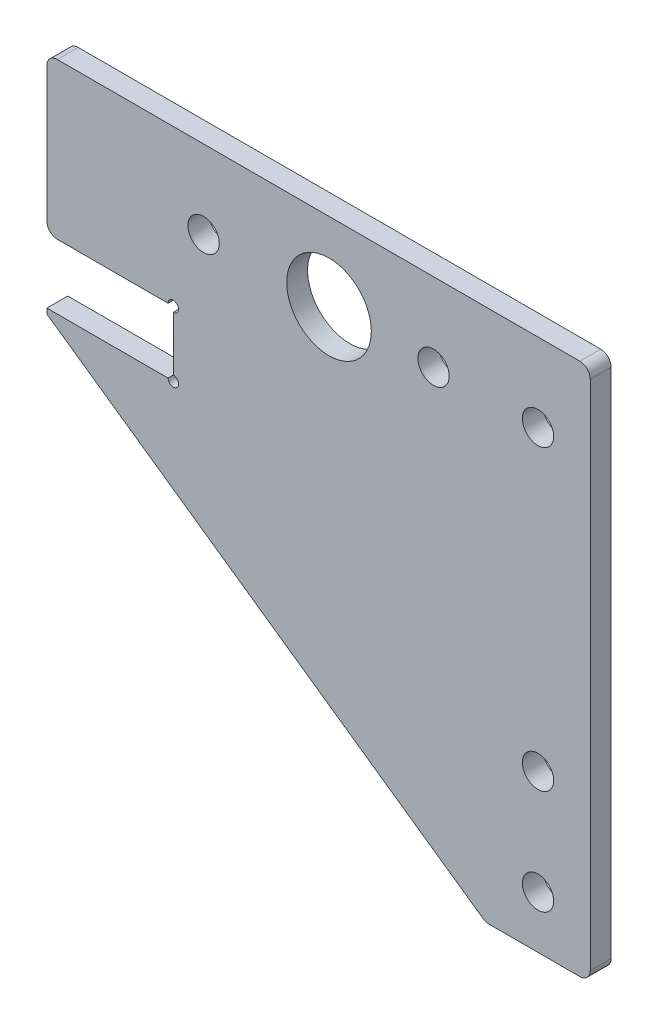
ISO-10303-21;
HEADER;
FILE_DESCRIPTION(('STEP AP214'),'2;1');
FILE_NAME('part.step','',(''),(''),'','','');
FILE_SCHEMA(('AUTOMOTIVE_DESIGN { 1 0 10303 214 1 1 1 1 }'));
ENDSEC;
DATA;
#1=APPLICATION_CONTEXT('core data for automotive mechanical design processes');
#2=APPLICATION_PROTOCOL_DEFINITION('international standard','automotive_design',2000,#1);
#3=PRODUCT_CONTEXT('',#1,'mechanical');
#4=PRODUCT('Part','Part','',(#3));
#5=PRODUCT_RELATED_PRODUCT_CATEGORY('part','',(#4));
#6=PRODUCT_DEFINITION_FORMATION('','',#4);
#7=PRODUCT_DEFINITION_CONTEXT('part definition',#1,'design');
#8=PRODUCT_DEFINITION('design','',#6,#7);
#9=PRODUCT_DEFINITION_SHAPE('','',#8);
#10=(LENGTH_UNIT() NAMED_UNIT(*) SI_UNIT(.MILLI.,.METRE.));
#11=(NAMED_UNIT(*) PLANE_ANGLE_UNIT() SI_UNIT($,.RADIAN.));
#12=(NAMED_UNIT(*) SI_UNIT($,.STERADIAN.) SOLID_ANGLE_UNIT());
#13=UNCERTAINTY_MEASURE_WITH_UNIT(LENGTH_MEASURE(1.E-05),#10,'distance_accuracy_value','');
#14=(GEOMETRIC_REPRESENTATION_CONTEXT(3) GLOBAL_UNCERTAINTY_ASSIGNED_CONTEXT((#13)) GLOBAL_UNIT_ASSIGNED_CONTEXT((#10,
#11,#12)) REPRESENTATION_CONTEXT('',''));
#15=CARTESIAN_POINT('',(0.,0.,0.));
#16=DIRECTION('',(0.,0.,1.));
#17=DIRECTION('',(1.,0.,0.));
#18=AXIS2_PLACEMENT_3D('',#15,#16,#17);
#19=CARTESIAN_POINT('',(0.,0.,2.));
#20=DIRECTION('',(0.,0.,-1.));
#21=DIRECTION('',(-1.,0.,0.));
#22=AXIS2_PLACEMENT_3D('',#19,#20,#21);
#23=PLANE('',#22);
#24=DIRECTION('',(0.819152044288991,-0.573576436351047,0.));
#25=VECTOR('',#24,1.);
#26=CARTESIAN_POINT('',(-47.,-14.0912833951921,2.));
#27=LINE('',#26,#25);
#28=CARTESIAN_POINT('',(-47.,-14.0912833951921,2.));
#29=VERTEX_POINT('',#28);
#30=CARTESIAN_POINT('',(-5.25827764747206,-43.319152044289,2.));
#31=VERTEX_POINT('',#30);
#32=EDGE_CURVE('E280',#29,#31,#27,.T.);
#33=ORIENTED_EDGE('',*,*,#32,.T.);
#34=CARTESIAN_POINT('',(-4.68470121112101,-42.5,2.));
#35=DIRECTION('',(0.,0.,-1.));
#36=DIRECTION('',(-1.,0.,0.));
#37=AXIS2_PLACEMENT_3D('',#34,#35,#36);
#38=CIRCLE('',#37,1.);
#39=CARTESIAN_POINT('',(-4.68470121112101,-43.5,2.));
#40=VERTEX_POINT('',#39);
#41=EDGE_CURVE('E236',#31,#40,#38,.F.);
#42=ORIENTED_EDGE('',*,*,#41,.T.);
#43=DIRECTION('',(1.,0.,0.));
#44=VECTOR('',#43,1.);
#45=CARTESIAN_POINT('',(-5.,-43.5,2.));
#46=LINE('',#45,#44);
#47=CARTESIAN_POINT('',(4.,-43.5,2.));
#48=VERTEX_POINT('',#47);
#49=EDGE_CURVE('E283',#40,#48,#46,.T.);
#50=ORIENTED_EDGE('',*,*,#49,.T.);
#51=CARTESIAN_POINT('',(4.,-42.5,2.));
#52=DIRECTION('',(0.,0.,-1.));
#53=DIRECTION('',(-1.,0.,0.));
#54=AXIS2_PLACEMENT_3D('',#51,#52,#53);
#55=CIRCLE('',#54,1.);
#56=CARTESIAN_POINT('',(5.,-42.5,2.));
#57=VERTEX_POINT('',#56);
#58=EDGE_CURVE('E234',#48,#57,#55,.F.);
#59=ORIENTED_EDGE('',*,*,#58,.T.);
#60=DIRECTION('',(0.,1.,0.));
#61=VECTOR('',#60,1.);
#62=CARTESIAN_POINT('',(5.,-43.5,2.));
#63=LINE('',#62,#61);
#64=CARTESIAN_POINT('',(5.,6.50000000000001,2.));
#65=VERTEX_POINT('',#64);
#66=EDGE_CURVE('E286',#57,#65,#63,.T.);
#67=ORIENTED_EDGE('',*,*,#66,.T.);
#68=CARTESIAN_POINT('',(4.,6.5,2.));
#69=DIRECTION('',(0.,0.,-1.));
#70=DIRECTION('',(-1.,0.,0.));
#71=AXIS2_PLACEMENT_3D('',#68,#69,#70);
#72=CIRCLE('',#71,1.);
#73=CARTESIAN_POINT('',(4.,7.5,2.));
#74=VERTEX_POINT('',#73);
#75=EDGE_CURVE('E232',#65,#74,#72,.F.);
#76=ORIENTED_EDGE('',*,*,#75,.T.);
#77=DIRECTION('',(-1.,0.,0.));
#78=VECTOR('',#77,1.);
#79=CARTESIAN_POINT('',(5.,7.5,2.));
#80=LINE('',#79,#78);
#81=CARTESIAN_POINT('',(-46.,7.50000000000001,2.));
#82=VERTEX_POINT('',#81);
#83=EDGE_CURVE('E289',#74,#82,#80,.T.);
#84=ORIENTED_EDGE('',*,*,#83,.T.);
#85=CARTESIAN_POINT('',(-46.,6.50000000000001,2.));
#86=DIRECTION('',(0.,0.,-1.));
#87=DIRECTION('',(-1.,0.,0.));
#88=AXIS2_PLACEMENT_3D('',#85,#86,#87);
#89=CIRCLE('',#88,1.);
#90=CARTESIAN_POINT('',(-47.,6.50000000000001,2.));
#91=VERTEX_POINT('',#90);
#92=EDGE_CURVE('E58',#82,#91,#89,.F.);
#93=ORIENTED_EDGE('',*,*,#92,.T.);
#94=DIRECTION('',(0.,-1.,0.));
#95=VECTOR('',#94,1.);
#96=CARTESIAN_POINT('',(-47.,7.50000000000001,2.));
#97=LINE('',#96,#95);
#98=CARTESIAN_POINT('',(-47.,-6.4,2.));
#99=VERTEX_POINT('',#98);
#100=EDGE_CURVE('E206',#91,#99,#97,.T.);
#101=ORIENTED_EDGE('',*,*,#100,.T.);
#102=CARTESIAN_POINT('',(-46.,-6.4,2.));
#103=DIRECTION('',(0.,0.,-1.));
#104=DIRECTION('',(-1.,0.,0.));
#105=AXIS2_PLACEMENT_3D('',#102,#103,#104);
#106=CIRCLE('',#105,1.);
#107=CARTESIAN_POINT('',(-46.,-7.4,2.));
#108=VERTEX_POINT('',#107);
#109=EDGE_CURVE('E230',#99,#108,#106,.F.);
#110=ORIENTED_EDGE('',*,*,#109,.T.);
#111=DIRECTION('',(1.,0.,0.));
#112=VECTOR('',#111,1.);
#113=CARTESIAN_POINT('',(-47.,-7.4,2.));
#114=LINE('',#113,#112);
#115=CARTESIAN_POINT('',(-35.4,-7.4,2.));
#116=VERTEX_POINT('',#115);
#117=EDGE_CURVE('E201',#108,#116,#114,.T.);
#118=ORIENTED_EDGE('',*,*,#117,.T.);
#119=CARTESIAN_POINT('',(-34.9,-7.4,2.));
#120=DIRECTION('',(0.,0.,-1.));
#121=DIRECTION('',(-1.,0.,0.));
#122=AXIS2_PLACEMENT_3D('',#119,#120,#121);
#123=CIRCLE('',#122,0.499999999999999);
#124=CARTESIAN_POINT('',(-34.9,-7.9,2.));
#125=VERTEX_POINT('',#124);
#126=EDGE_CURVE('E161',#116,#125,#123,.T.);
#127=ORIENTED_EDGE('',*,*,#126,.T.);
#128=DIRECTION('',(0.,-1.,0.));
#129=VECTOR('',#128,1.);
#130=CARTESIAN_POINT('',(-34.9,-7.4,2.));
#131=LINE('',#130,#129);
#132=CARTESIAN_POINT('',(-34.9,-13.1,2.));
#133=VERTEX_POINT('',#132);
#134=EDGE_CURVE('E269',#125,#133,#131,.T.);
#135=ORIENTED_EDGE('',*,*,#134,.T.);
#136=CARTESIAN_POINT('',(-34.9,-13.6,2.));
#137=DIRECTION('',(0.,0.,-1.));
#138=DIRECTION('',(-1.,0.,0.));
#139=AXIS2_PLACEMENT_3D('',#136,#137,#138);
#140=CIRCLE('',#139,0.499999999999999);
#141=CARTESIAN_POINT('',(-35.4,-13.6,2.));
#142=VERTEX_POINT('',#141);
#143=EDGE_CURVE('E156',#133,#142,#140,.T.);
#144=ORIENTED_EDGE('',*,*,#143,.T.);
#145=DIRECTION('',(-1.,0.,0.));
#146=VECTOR('',#145,1.);
#147=CARTESIAN_POINT('',(-34.9,-13.6,2.));
#148=LINE('',#147,#146);
#149=CARTESIAN_POINT('',(-47.,-13.6,2.));
#150=VERTEX_POINT('',#149);
#151=EDGE_CURVE('E271',#142,#150,#148,.T.);
#152=ORIENTED_EDGE('',*,*,#151,.T.);
#153=DIRECTION('',(0.,-1.,0.));
#154=VECTOR('',#153,1.);
#155=CARTESIAN_POINT('',(-47.,-13.6,2.));
#156=LINE('',#155,#154);
#157=EDGE_CURVE('E278',#150,#29,#156,.T.);
#158=ORIENTED_EDGE('',*,*,#157,.T.);
#159=EDGE_LOOP('',(#33,#42,#50,#59,#67,#76,#84,#93,#101,#110,#118,#127,#135,#144,#152,#158));
#160=FACE_BOUND('',#159,.T.);
#161=CARTESIAN_POINT('',(0.,0.,2.));
#162=DIRECTION('',(0.,0.,1.));
#163=DIRECTION('',(1.,0.,0.));
#164=AXIS2_PLACEMENT_3D('',#161,#162,#163);
#165=CIRCLE('',#164,1.5);
#166=CARTESIAN_POINT('',(1.5,0.,2.));
#167=VERTEX_POINT('',#166);
#168=EDGE_CURVE('E182',#167,#167,#165,.T.);
#169=ORIENTED_EDGE('',*,*,#168,.F.);
#170=EDGE_LOOP('',(#169));
#171=FACE_BOUND('',#170,.T.);
#172=CARTESIAN_POINT('',(-32.,0.,2.));
#173=DIRECTION('',(0.,0.,1.));
#174=DIRECTION('',(1.,0.,0.));
#175=AXIS2_PLACEMENT_3D('',#172,#173,#174);
#176=CIRCLE('',#175,1.50000000000003);
#177=CARTESIAN_POINT('',(-30.5,0.,2.));
#178=VERTEX_POINT('',#177);
#179=EDGE_CURVE('E301',#178,#178,#176,.T.);
#180=ORIENTED_EDGE('',*,*,#179,.F.);
#181=EDGE_LOOP('',(#180));
#182=FACE_BOUND('',#181,.T.);
#183=CARTESIAN_POINT('',(0.,-28.5,2.));
#184=DIRECTION('',(0.,0.,1.));
#185=DIRECTION('',(1.,0.,0.));
#186=AXIS2_PLACEMENT_3D('',#183,#184,#185);
#187=CIRCLE('',#186,1.5);
#188=CARTESIAN_POINT('',(1.5,-28.5,2.));
#189=VERTEX_POINT('',#188);
#190=EDGE_CURVE('E305',#189,#189,#187,.T.);
#191=ORIENTED_EDGE('',*,*,#190,.F.);
#192=EDGE_LOOP('',(#191));
#193=FACE_BOUND('',#192,.T.);
#194=CARTESIAN_POINT('',(-10.,0.,2.));
#195=DIRECTION('',(0.,0.,1.));
#196=DIRECTION('',(1.,0.,0.));
#197=AXIS2_PLACEMENT_3D('',#194,#195,#196);
#198=CIRCLE('',#197,1.5);
#199=CARTESIAN_POINT('',(-8.5,0.,2.));
#200=VERTEX_POINT('',#199);
#201=EDGE_CURVE('E309',#200,#200,#198,.T.);
#202=ORIENTED_EDGE('',*,*,#201,.F.);
#203=EDGE_LOOP('',(#202));
#204=FACE_BOUND('',#203,.T.);
#205=CARTESIAN_POINT('',(0.,-38.5,2.));
#206=DIRECTION('',(0.,0.,1.));
#207=DIRECTION('',(1.,0.,0.));
#208=AXIS2_PLACEMENT_3D('',#205,#206,#207);
#209=CIRCLE('',#208,1.5);
#210=CARTESIAN_POINT('',(1.50000000000001,-38.5,2.));
#211=VERTEX_POINT('',#210);
#212=EDGE_CURVE('E313',#211,#211,#209,.T.);
#213=ORIENTED_EDGE('',*,*,#212,.F.);
#214=EDGE_LOOP('',(#213));
#215=FACE_BOUND('',#214,.T.);
#216=CARTESIAN_POINT('',(-20.,0.,2.));
#217=DIRECTION('',(0.,0.,1.));
#218=DIRECTION('',(1.,0.,0.));
#219=AXIS2_PLACEMENT_3D('',#216,#217,#218);
#220=CIRCLE('',#219,4.05);
#221=CARTESIAN_POINT('',(-15.95,0.,2.));
#222=VERTEX_POINT('',#221);
#223=EDGE_CURVE('E316',#222,#222,#220,.T.);
#224=ORIENTED_EDGE('',*,*,#223,.F.);
#225=EDGE_LOOP('',(#224));
#226=FACE_BOUND('',#225,.T.);
#227=ADVANCED_FACE('F38',(#160,#171,#182,#193,#204,#215,#226),#23,.F.);
#228=CARTESIAN_POINT('',(0.,0.,0.));
#229=DIRECTION('',(0.,0.,-1.));
#230=DIRECTION('',(-1.,0.,0.));
#231=AXIS2_PLACEMENT_3D('',#228,#229,#230);
#232=PLANE('',#231);
#233=DIRECTION('',(1.,0.,0.));
#234=VECTOR('',#233,1.);
#235=CARTESIAN_POINT('',(-5.,-43.5,0.));
#236=LINE('',#235,#234);
#237=CARTESIAN_POINT('',(-4.68470121112101,-43.5,0.));
#238=VERTEX_POINT('',#237);
#239=CARTESIAN_POINT('',(4.,-43.5,0.));
#240=VERTEX_POINT('',#239);
#241=EDGE_CURVE('E190',#238,#240,#236,.T.);
#242=ORIENTED_EDGE('',*,*,#241,.F.);
#243=CARTESIAN_POINT('',(-4.68470121112101,-42.5,0.));
#244=DIRECTION('',(0.,0.,-1.));
#245=DIRECTION('',(-1.,0.,0.));
#246=AXIS2_PLACEMENT_3D('',#243,#244,#245);
#247=CIRCLE('',#246,1.);
#248=CARTESIAN_POINT('',(-5.25827764747206,-43.319152044289,0.));
#249=VERTEX_POINT('',#248);
#250=EDGE_CURVE('E225',#238,#249,#247,.T.);
#251=ORIENTED_EDGE('',*,*,#250,.T.);
#252=DIRECTION('',(0.819152044288991,-0.573576436351047,0.));
#253=VECTOR('',#252,1.);
#254=CARTESIAN_POINT('',(-47.,-14.0912833951921,0.));
#255=LINE('',#254,#253);
#256=CARTESIAN_POINT('',(-47.,-14.0912833951921,0.));
#257=VERTEX_POINT('',#256);
#258=EDGE_CURVE('E187',#257,#249,#255,.T.);
#259=ORIENTED_EDGE('',*,*,#258,.F.);
#260=DIRECTION('',(0.,-1.,0.));
#261=VECTOR('',#260,1.);
#262=CARTESIAN_POINT('',(-47.,-13.6,0.));
#263=LINE('',#262,#261);
#264=CARTESIAN_POINT('',(-47.,-13.6,0.));
#265=VERTEX_POINT('',#264);
#266=EDGE_CURVE('E180',#265,#257,#263,.T.);
#267=ORIENTED_EDGE('',*,*,#266,.F.);
#268=DIRECTION('',(-1.,0.,0.));
#269=VECTOR('',#268,1.);
#270=CARTESIAN_POINT('',(-34.9,-13.6,0.));
#271=LINE('',#270,#269);
#272=CARTESIAN_POINT('',(-35.4,-13.6,0.));
#273=VERTEX_POINT('',#272);
#274=EDGE_CURVE('E172',#273,#265,#271,.T.);
#275=ORIENTED_EDGE('',*,*,#274,.F.);
#276=CARTESIAN_POINT('',(-34.9,-13.6,0.));
#277=DIRECTION('',(0.,0.,-1.));
#278=DIRECTION('',(-1.,0.,0.));
#279=AXIS2_PLACEMENT_3D('',#276,#277,#278);
#280=CIRCLE('',#279,0.499999999999999);
#281=CARTESIAN_POINT('',(-34.9,-13.1,0.));
#282=VERTEX_POINT('',#281);
#283=EDGE_CURVE('E153',#282,#273,#280,.T.);
#284=ORIENTED_EDGE('',*,*,#283,.F.);
#285=DIRECTION('',(0.,-1.,0.));
#286=VECTOR('',#285,1.);
#287=CARTESIAN_POINT('',(-34.9,-7.4,0.));
#288=LINE('',#287,#286);
#289=CARTESIAN_POINT('',(-34.9,-7.9,0.));
#290=VERTEX_POINT('',#289);
#291=EDGE_CURVE('E170',#290,#282,#288,.T.);
#292=ORIENTED_EDGE('',*,*,#291,.F.);
#293=CARTESIAN_POINT('',(-34.9,-7.4,0.));
#294=DIRECTION('',(0.,0.,-1.));
#295=DIRECTION('',(-1.,0.,0.));
#296=AXIS2_PLACEMENT_3D('',#293,#294,#295);
#297=CIRCLE('',#296,0.499999999999999);
#298=CARTESIAN_POINT('',(-35.4,-7.4,0.));
#299=VERTEX_POINT('',#298);
#300=EDGE_CURVE('E173',#299,#290,#297,.T.);
#301=ORIENTED_EDGE('',*,*,#300,.F.);
#302=DIRECTION('',(1.,0.,0.));
#303=VECTOR('',#302,1.);
#304=CARTESIAN_POINT('',(-47.,-7.4,0.));
#305=LINE('',#304,#303);
#306=CARTESIAN_POINT('',(-46.,-7.4,0.));
#307=VERTEX_POINT('',#306);
#308=EDGE_CURVE('E178',#307,#299,#305,.T.);
#309=ORIENTED_EDGE('',*,*,#308,.F.);
#310=CARTESIAN_POINT('',(-46.,-6.4,0.));
#311=DIRECTION('',(0.,0.,-1.));
#312=DIRECTION('',(-1.,0.,0.));
#313=AXIS2_PLACEMENT_3D('',#310,#311,#312);
#314=CIRCLE('',#313,1.);
#315=CARTESIAN_POINT('',(-47.,-6.4,0.));
#316=VERTEX_POINT('',#315);
#317=EDGE_CURVE('E219',#307,#316,#314,.T.);
#318=ORIENTED_EDGE('',*,*,#317,.T.);
#319=DIRECTION('',(0.,-1.,0.));
#320=VECTOR('',#319,1.);
#321=CARTESIAN_POINT('',(-47.,7.50000000000001,0.));
#322=LINE('',#321,#320);
#323=CARTESIAN_POINT('',(-47.,6.50000000000001,0.));
#324=VERTEX_POINT('',#323);
#325=EDGE_CURVE('E199',#324,#316,#322,.T.);
#326=ORIENTED_EDGE('',*,*,#325,.F.);
#327=CARTESIAN_POINT('',(-46.,6.50000000000001,0.));
#328=DIRECTION('',(0.,0.,-1.));
#329=DIRECTION('',(-1.,0.,0.));
#330=AXIS2_PLACEMENT_3D('',#327,#328,#329);
#331=CIRCLE('',#330,1.);
#332=CARTESIAN_POINT('',(-46.,7.50000000000001,0.));
#333=VERTEX_POINT('',#332);
#334=EDGE_CURVE('E217',#324,#333,#331,.T.);
#335=ORIENTED_EDGE('',*,*,#334,.T.);
#336=DIRECTION('',(-1.,0.,0.));
#337=VECTOR('',#336,1.);
#338=CARTESIAN_POINT('',(5.,7.5,0.));
#339=LINE('',#338,#337);
#340=CARTESIAN_POINT('',(4.,7.5,0.));
#341=VERTEX_POINT('',#340);
#342=EDGE_CURVE('E196',#341,#333,#339,.T.);
#343=ORIENTED_EDGE('',*,*,#342,.F.);
#344=CARTESIAN_POINT('',(4.,6.5,0.));
#345=DIRECTION('',(0.,0.,-1.));
#346=DIRECTION('',(-1.,0.,0.));
#347=AXIS2_PLACEMENT_3D('',#344,#345,#346);
#348=CIRCLE('',#347,1.);
#349=CARTESIAN_POINT('',(5.,6.50000000000001,0.));
#350=VERTEX_POINT('',#349);
#351=EDGE_CURVE('E221',#341,#350,#348,.T.);
#352=ORIENTED_EDGE('',*,*,#351,.T.);
#353=DIRECTION('',(0.,1.,0.));
#354=VECTOR('',#353,1.);
#355=CARTESIAN_POINT('',(5.,-43.5,0.));
#356=LINE('',#355,#354);
#357=CARTESIAN_POINT('',(5.,-42.5,0.));
#358=VERTEX_POINT('',#357);
#359=EDGE_CURVE('E193',#358,#350,#356,.T.);
#360=ORIENTED_EDGE('',*,*,#359,.F.);
#361=CARTESIAN_POINT('',(4.,-42.5,0.));
#362=DIRECTION('',(0.,0.,-1.));
#363=DIRECTION('',(-1.,0.,0.));
#364=AXIS2_PLACEMENT_3D('',#361,#362,#363);
#365=CIRCLE('',#364,1.);
#366=EDGE_CURVE('E223',#358,#240,#365,.T.);
#367=ORIENTED_EDGE('',*,*,#366,.T.);
#368=EDGE_LOOP('',(#242,#251,#259,#267,#275,#284,#292,#301,#309,#318,#326,#335,#343,#352,#360,#367));
#369=FACE_BOUND('',#368,.T.);
#370=CARTESIAN_POINT('',(0.,-38.5,0.));
#371=DIRECTION('',(0.,0.,1.));
#372=DIRECTION('',(1.,0.,0.));
#373=AXIS2_PLACEMENT_3D('',#370,#371,#372);
#374=CIRCLE('',#373,1.5);
#375=CARTESIAN_POINT('',(1.50000000000001,-38.5,0.));
#376=VERTEX_POINT('',#375);
#377=EDGE_CURVE('E318',#376,#376,#374,.T.);
#378=ORIENTED_EDGE('',*,*,#377,.T.);
#379=EDGE_LOOP('',(#378));
#380=FACE_BOUND('',#379,.T.);
#381=CARTESIAN_POINT('',(0.,-28.5,0.));
#382=DIRECTION('',(0.,0.,1.));
#383=DIRECTION('',(1.,0.,0.));
#384=AXIS2_PLACEMENT_3D('',#381,#382,#383);
#385=CIRCLE('',#384,1.5);
#386=CARTESIAN_POINT('',(1.5,-28.5,0.));
#387=VERTEX_POINT('',#386);
#388=EDGE_CURVE('E331',#387,#387,#385,.T.);
#389=ORIENTED_EDGE('',*,*,#388,.T.);
#390=EDGE_LOOP('',(#389));
#391=FACE_BOUND('',#390,.T.);
#392=CARTESIAN_POINT('',(0.,0.,0.));
#393=DIRECTION('',(0.,0.,1.));
#394=DIRECTION('',(1.,0.,0.));
#395=AXIS2_PLACEMENT_3D('',#392,#393,#394);
#396=CIRCLE('',#395,1.5);
#397=CARTESIAN_POINT('',(1.5,0.,0.));
#398=VERTEX_POINT('',#397);
#399=EDGE_CURVE('E274',#398,#398,#396,.T.);
#400=ORIENTED_EDGE('',*,*,#399,.T.);
#401=EDGE_LOOP('',(#400));
#402=FACE_BOUND('',#401,.T.);
#403=CARTESIAN_POINT('',(-32.,0.,0.));
#404=DIRECTION('',(0.,0.,1.));
#405=DIRECTION('',(1.,0.,0.));
#406=AXIS2_PLACEMENT_3D('',#403,#404,#405);
#407=CIRCLE('',#406,1.50000000000003);
#408=CARTESIAN_POINT('',(-30.5,0.,0.));
#409=VERTEX_POINT('',#408);
#410=EDGE_CURVE('E335',#409,#409,#407,.T.);
#411=ORIENTED_EDGE('',*,*,#410,.T.);
#412=EDGE_LOOP('',(#411));
#413=FACE_BOUND('',#412,.T.);
#414=CARTESIAN_POINT('',(-10.,0.,0.));
#415=DIRECTION('',(0.,0.,1.));
#416=DIRECTION('',(1.,0.,0.));
#417=AXIS2_PLACEMENT_3D('',#414,#415,#416);
#418=CIRCLE('',#417,1.5);
#419=CARTESIAN_POINT('',(-8.5,0.,0.));
#420=VERTEX_POINT('',#419);
#421=EDGE_CURVE('E328',#420,#420,#418,.T.);
#422=ORIENTED_EDGE('',*,*,#421,.T.);
#423=EDGE_LOOP('',(#422));
#424=FACE_BOUND('',#423,.T.);
#425=CARTESIAN_POINT('',(-20.,0.,0.));
#426=DIRECTION('',(0.,0.,1.));
#427=DIRECTION('',(1.,0.,0.));
#428=AXIS2_PLACEMENT_3D('',#425,#426,#427);
#429=CIRCLE('',#428,4.05);
#430=CARTESIAN_POINT('',(-15.95,0.,0.));
#431=VERTEX_POINT('',#430);
#432=EDGE_CURVE('E319',#431,#431,#429,.T.);
#433=ORIENTED_EDGE('',*,*,#432,.T.);
#434=EDGE_LOOP('',(#433));
#435=FACE_BOUND('',#434,.T.);
#436=ADVANCED_FACE('F167',(#369,#380,#391,#402,#413,#424,#435),#232,.T.);
#437=CARTESIAN_POINT('',(-47.,-7.4,2.));
#438=DIRECTION('',(0.,1.,0.));
#439=DIRECTION('',(0.,0.,1.));
#440=AXIS2_PLACEMENT_3D('',#437,#438,#439);
#441=PLANE('',#440);
#442=ORIENTED_EDGE('',*,*,#117,.F.);
#443=DIRECTION('',(0.,0.,-1.));
#444=VECTOR('',#443,1.);
#445=CARTESIAN_POINT('',(-46.,-7.4,2.));
#446=LINE('',#445,#444);
#447=EDGE_CURVE('E248',#108,#307,#446,.T.);
#448=ORIENTED_EDGE('',*,*,#447,.T.);
#449=ORIENTED_EDGE('',*,*,#308,.T.);
#450=DIRECTION('',(0.,0.,-1.));
#451=VECTOR('',#450,1.);
#452=CARTESIAN_POINT('',(-35.4,-7.4,10.));
#453=LINE('',#452,#451);
#454=EDGE_CURVE('E266',#299,#116,#453,.F.);
#455=ORIENTED_EDGE('',*,*,#454,.T.);
#456=EDGE_LOOP('',(#442,#448,#449,#455));
#457=FACE_BOUND('',#456,.T.);
#458=ADVANCED_FACE('F263',(#457),#441,.F.);
#459=CARTESIAN_POINT('',(-34.9,-7.4,2.));
#460=DIRECTION('',(1.,0.,0.));
#461=DIRECTION('',(0.,0.,-1.));
#462=AXIS2_PLACEMENT_3D('',#459,#460,#461);
#463=PLANE('',#462);
#464=ORIENTED_EDGE('',*,*,#134,.F.);
#465=DIRECTION('',(0.,0.,-1.));
#466=VECTOR('',#465,1.);
#467=CARTESIAN_POINT('',(-34.9,-7.9,10.));
#468=LINE('',#467,#466);
#469=EDGE_CURVE('E177',#125,#290,#468,.T.);
#470=ORIENTED_EDGE('',*,*,#469,.T.);
#471=ORIENTED_EDGE('',*,*,#291,.T.);
#472=DIRECTION('',(0.,0.,-1.));
#473=VECTOR('',#472,1.);
#474=CARTESIAN_POINT('',(-34.9,-13.1,10.));
#475=LINE('',#474,#473);
#476=EDGE_CURVE('E150',#282,#133,#475,.F.);
#477=ORIENTED_EDGE('',*,*,#476,.T.);
#478=EDGE_LOOP('',(#464,#470,#471,#477));
#479=FACE_BOUND('',#478,.T.);
#480=ADVANCED_FACE('F176',(#479),#463,.F.);
#481=CARTESIAN_POINT('',(-34.9,-13.6,2.));
#482=DIRECTION('',(0.,-1.,0.));
#483=DIRECTION('',(1.,0.,0.));
#484=AXIS2_PLACEMENT_3D('',#481,#482,#483);
#485=PLANE('',#484);
#486=ORIENTED_EDGE('',*,*,#151,.F.);
#487=DIRECTION('',(0.,0.,-1.));
#488=VECTOR('',#487,1.);
#489=CARTESIAN_POINT('',(-35.4,-13.6,10.));
#490=LINE('',#489,#488);
#491=EDGE_CURVE('E209',#142,#273,#490,.T.);
#492=ORIENTED_EDGE('',*,*,#491,.T.);
#493=ORIENTED_EDGE('',*,*,#274,.T.);
#494=DIRECTION('',(0.,0.,-1.));
#495=VECTOR('',#494,1.);
#496=CARTESIAN_POINT('',(-47.,-13.6,2.));
#497=LINE('',#496,#495);
#498=EDGE_CURVE('E205',#150,#265,#497,.T.);
#499=ORIENTED_EDGE('',*,*,#498,.F.);
#500=EDGE_LOOP('',(#486,#492,#493,#499));
#501=FACE_BOUND('',#500,.T.);
#502=ADVANCED_FACE('F381',(#501),#485,.F.);
#503=CARTESIAN_POINT('',(-47.,-13.6,2.));
#504=DIRECTION('',(1.,0.,0.));
#505=DIRECTION('',(0.,0.,-1.));
#506=AXIS2_PLACEMENT_3D('',#503,#504,#505);
#507=PLANE('',#506);
#508=ORIENTED_EDGE('',*,*,#266,.T.);
#509=DIRECTION('',(0.,0.,-1.));
#510=VECTOR('',#509,1.);
#511=CARTESIAN_POINT('',(-47.,-14.0912833951921,2.));
#512=LINE('',#511,#510);
#513=EDGE_CURVE('E202',#29,#257,#512,.T.);
#514=ORIENTED_EDGE('',*,*,#513,.F.);
#515=ORIENTED_EDGE('',*,*,#157,.F.);
#516=ORIENTED_EDGE('',*,*,#498,.T.);
#517=EDGE_LOOP('',(#508,#514,#515,#516));
#518=FACE_BOUND('',#517,.T.);
#519=ADVANCED_FACE('F377',(#518),#507,.F.);
#520=CARTESIAN_POINT('',(-47.,-14.0912833951921,2.));
#521=DIRECTION('',(0.573576436351047,0.819152044288991,0.));
#522=DIRECTION('',(-0.819152044288991,0.573576436351047,0.));
#523=AXIS2_PLACEMENT_3D('',#520,#521,#522);
#524=PLANE('',#523);
#525=ORIENTED_EDGE('',*,*,#258,.T.);
#526=DIRECTION('',(0.,0.,-1.));
#527=VECTOR('',#526,1.);
#528=CARTESIAN_POINT('',(-5.25827764747207,-43.319152044289,2.));
#529=LINE('',#528,#527);
#530=EDGE_CURVE('E227',#249,#31,#529,.F.);
#531=ORIENTED_EDGE('',*,*,#530,.T.);
#532=ORIENTED_EDGE('',*,*,#32,.F.);
#533=ORIENTED_EDGE('',*,*,#513,.T.);
#534=EDGE_LOOP('',(#525,#531,#532,#533));
#535=FACE_BOUND('',#534,.T.);
#536=ADVANCED_FACE('F373',(#535),#524,.F.);
#537=CARTESIAN_POINT('',(-5.,-43.5,2.));
#538=DIRECTION('',(0.,1.,0.));
#539=DIRECTION('',(0.,0.,1.));
#540=AXIS2_PLACEMENT_3D('',#537,#538,#539);
#541=PLANE('',#540);
#542=ORIENTED_EDGE('',*,*,#49,.F.);
#543=DIRECTION('',(0.,0.,-1.));
#544=VECTOR('',#543,1.);
#545=CARTESIAN_POINT('',(-4.68470121112101,-43.5,2.));
#546=LINE('',#545,#544);
#547=EDGE_CURVE('E214',#40,#238,#546,.T.);
#548=ORIENTED_EDGE('',*,*,#547,.T.);
#549=ORIENTED_EDGE('',*,*,#241,.T.);
#550=DIRECTION('',(0.,0.,-1.));
#551=VECTOR('',#550,1.);
#552=CARTESIAN_POINT('',(4.,-43.5,2.));
#553=LINE('',#552,#551);
#554=EDGE_CURVE('E212',#240,#48,#553,.F.);
#555=ORIENTED_EDGE('',*,*,#554,.T.);
#556=EDGE_LOOP('',(#542,#548,#549,#555));
#557=FACE_BOUND('',#556,.T.);
#558=ADVANCED_FACE('F369',(#557),#541,.F.);
#559=CARTESIAN_POINT('',(5.,-43.5,2.));
#560=DIRECTION('',(-1.,0.,0.));
#561=DIRECTION('',(0.,0.,1.));
#562=AXIS2_PLACEMENT_3D('',#559,#560,#561);
#563=PLANE('',#562);
#564=ORIENTED_EDGE('',*,*,#66,.F.);
#565=DIRECTION('',(0.,0.,-1.));
#566=VECTOR('',#565,1.);
#567=CARTESIAN_POINT('',(5.,-42.5,2.));
#568=LINE('',#567,#566);
#569=EDGE_CURVE('E240',#57,#358,#568,.T.);
#570=ORIENTED_EDGE('',*,*,#569,.T.);
#571=ORIENTED_EDGE('',*,*,#359,.T.);
#572=DIRECTION('',(0.,0.,-1.));
#573=VECTOR('',#572,1.);
#574=CARTESIAN_POINT('',(5.,6.50000000000001,2.));
#575=LINE('',#574,#573);
#576=EDGE_CURVE('E238',#350,#65,#575,.F.);
#577=ORIENTED_EDGE('',*,*,#576,.T.);
#578=EDGE_LOOP('',(#564,#570,#571,#577));
#579=FACE_BOUND('',#578,.T.);
#580=ADVANCED_FACE('F365',(#579),#563,.F.);
#581=CARTESIAN_POINT('',(5.,7.5,2.));
#582=DIRECTION('',(0.,-1.,0.));
#583=DIRECTION('',(1.,0.,0.));
#584=AXIS2_PLACEMENT_3D('',#581,#582,#583);
#585=PLANE('',#584);
#586=ORIENTED_EDGE('',*,*,#83,.F.);
#587=DIRECTION('',(0.,0.,-1.));
#588=VECTOR('',#587,1.);
#589=CARTESIAN_POINT('',(4.,7.5,2.));
#590=LINE('',#589,#588);
#591=EDGE_CURVE('E245',#74,#341,#590,.T.);
#592=ORIENTED_EDGE('',*,*,#591,.T.);
#593=ORIENTED_EDGE('',*,*,#342,.T.);
#594=DIRECTION('',(0.,0.,-1.));
#595=VECTOR('',#594,1.);
#596=CARTESIAN_POINT('',(-46.,7.50000000000001,2.));
#597=LINE('',#596,#595);
#598=EDGE_CURVE('E243',#333,#82,#597,.F.);
#599=ORIENTED_EDGE('',*,*,#598,.T.);
#600=EDGE_LOOP('',(#586,#592,#593,#599));
#601=FACE_BOUND('',#600,.T.);
#602=ADVANCED_FACE('F357',(#601),#585,.F.);
#603=CARTESIAN_POINT('',(-47.,7.50000000000001,2.));
#604=DIRECTION('',(1.,0.,0.));
#605=DIRECTION('',(0.,0.,-1.));
#606=AXIS2_PLACEMENT_3D('',#603,#604,#605);
#607=PLANE('',#606);
#608=ORIENTED_EDGE('',*,*,#325,.T.);
#609=DIRECTION('',(0.,0.,-1.));
#610=VECTOR('',#609,1.);
#611=CARTESIAN_POINT('',(-47.,-6.4,2.));
#612=LINE('',#611,#610);
#613=EDGE_CURVE('E11',#316,#99,#612,.F.);
#614=ORIENTED_EDGE('',*,*,#613,.T.);
#615=ORIENTED_EDGE('',*,*,#100,.F.);
#616=DIRECTION('',(0.,0.,-1.));
#617=VECTOR('',#616,1.);
#618=CARTESIAN_POINT('',(-47.,6.50000000000001,2.));
#619=LINE('',#618,#617);
#620=EDGE_CURVE('E46',#91,#324,#619,.T.);
#621=ORIENTED_EDGE('',*,*,#620,.T.);
#622=EDGE_LOOP('',(#608,#614,#615,#621));
#623=FACE_BOUND('',#622,.T.);
#624=ADVANCED_FACE('F253',(#623),#607,.F.);
#625=CARTESIAN_POINT('',(0.,0.,2.));
#626=DIRECTION('',(0.,0.,-1.));
#627=DIRECTION('',(-1.,0.,0.));
#628=AXIS2_PLACEMENT_3D('',#625,#626,#627);
#629=CYLINDRICAL_SURFACE('',#628,1.5);
#630=ORIENTED_EDGE('',*,*,#168,.T.);
#631=EDGE_LOOP('',(#630));
#632=FACE_BOUND('',#631,.T.);
#633=ORIENTED_EDGE('',*,*,#399,.F.);
#634=EDGE_LOOP('',(#633));
#635=FACE_BOUND('',#634,.T.);
#636=ADVANCED_FACE('F346',(#632,#635),#629,.F.);
#637=CARTESIAN_POINT('',(-32.,0.,2.));
#638=DIRECTION('',(0.,0.,-1.));
#639=DIRECTION('',(-1.,0.,0.));
#640=AXIS2_PLACEMENT_3D('',#637,#638,#639);
#641=CYLINDRICAL_SURFACE('',#640,1.50000000000003);
#642=ORIENTED_EDGE('',*,*,#179,.T.);
#643=EDGE_LOOP('',(#642));
#644=FACE_BOUND('',#643,.T.);
#645=ORIENTED_EDGE('',*,*,#410,.F.);
#646=EDGE_LOOP('',(#645));
#647=FACE_BOUND('',#646,.T.);
#648=ADVANCED_FACE('F348',(#644,#647),#641,.F.);
#649=CARTESIAN_POINT('',(0.,-28.5,2.));
#650=DIRECTION('',(0.,0.,-1.));
#651=DIRECTION('',(-1.,0.,0.));
#652=AXIS2_PLACEMENT_3D('',#649,#650,#651);
#653=CYLINDRICAL_SURFACE('',#652,1.5);
#654=ORIENTED_EDGE('',*,*,#190,.T.);
#655=EDGE_LOOP('',(#654));
#656=FACE_BOUND('',#655,.T.);
#657=ORIENTED_EDGE('',*,*,#388,.F.);
#658=EDGE_LOOP('',(#657));
#659=FACE_BOUND('',#658,.T.);
#660=ADVANCED_FACE('F354',(#656,#659),#653,.F.);
#661=CARTESIAN_POINT('',(-10.,0.,2.));
#662=DIRECTION('',(0.,0.,-1.));
#663=DIRECTION('',(-1.,0.,0.));
#664=AXIS2_PLACEMENT_3D('',#661,#662,#663);
#665=CYLINDRICAL_SURFACE('',#664,1.5);
#666=ORIENTED_EDGE('',*,*,#201,.T.);
#667=EDGE_LOOP('',(#666));
#668=FACE_BOUND('',#667,.T.);
#669=ORIENTED_EDGE('',*,*,#421,.F.);
#670=EDGE_LOOP('',(#669));
#671=FACE_BOUND('',#670,.T.);
#672=ADVANCED_FACE('F442',(#668,#671),#665,.F.);
#673=CARTESIAN_POINT('',(0.,-38.5,2.));
#674=DIRECTION('',(0.,0.,-1.));
#675=DIRECTION('',(-1.,0.,0.));
#676=AXIS2_PLACEMENT_3D('',#673,#674,#675);
#677=CYLINDRICAL_SURFACE('',#676,1.5);
#678=ORIENTED_EDGE('',*,*,#212,.T.);
#679=EDGE_LOOP('',(#678));
#680=FACE_BOUND('',#679,.T.);
#681=ORIENTED_EDGE('',*,*,#377,.F.);
#682=EDGE_LOOP('',(#681));
#683=FACE_BOUND('',#682,.T.);
#684=ADVANCED_FACE('F439',(#680,#683),#677,.F.);
#685=CARTESIAN_POINT('',(-20.,0.,2.));
#686=DIRECTION('',(0.,0.,-1.));
#687=DIRECTION('',(-1.,0.,0.));
#688=AXIS2_PLACEMENT_3D('',#685,#686,#687);
#689=CYLINDRICAL_SURFACE('',#688,4.05);
#690=ORIENTED_EDGE('',*,*,#223,.T.);
#691=EDGE_LOOP('',(#690));
#692=FACE_BOUND('',#691,.T.);
#693=ORIENTED_EDGE('',*,*,#432,.F.);
#694=EDGE_LOOP('',(#693));
#695=FACE_BOUND('',#694,.T.);
#696=ADVANCED_FACE('F434',(#692,#695),#689,.F.);
#697=CARTESIAN_POINT('',(-34.9,-13.6,10.));
#698=DIRECTION('',(0.,0.,-1.));
#699=DIRECTION('',(-1.,0.,0.));
#700=AXIS2_PLACEMENT_3D('',#697,#698,#699);
#701=CYLINDRICAL_SURFACE('',#700,0.499999999999999);
#702=ORIENTED_EDGE('',*,*,#283,.T.);
#703=ORIENTED_EDGE('',*,*,#491,.F.);
#704=ORIENTED_EDGE('',*,*,#143,.F.);
#705=ORIENTED_EDGE('',*,*,#476,.F.);
#706=EDGE_LOOP('',(#702,#703,#704,#705));
#707=FACE_BOUND('',#706,.T.);
#708=ADVANCED_FACE('F152',(#707),#701,.F.);
#709=CARTESIAN_POINT('',(-34.9,-7.4,10.));
#710=DIRECTION('',(0.,0.,-1.));
#711=DIRECTION('',(-1.,0.,0.));
#712=AXIS2_PLACEMENT_3D('',#709,#710,#711);
#713=CYLINDRICAL_SURFACE('',#712,0.499999999999999);
#714=ORIENTED_EDGE('',*,*,#300,.T.);
#715=ORIENTED_EDGE('',*,*,#469,.F.);
#716=ORIENTED_EDGE('',*,*,#126,.F.);
#717=ORIENTED_EDGE('',*,*,#454,.F.);
#718=EDGE_LOOP('',(#714,#715,#716,#717));
#719=FACE_BOUND('',#718,.T.);
#720=ADVANCED_FACE('F394',(#719),#713,.F.);
#721=CARTESIAN_POINT('',(-4.68470121112101,-42.5,2.));
#722=DIRECTION('',(0.,0.,-1.));
#723=DIRECTION('',(-1.,0.,0.));
#724=AXIS2_PLACEMENT_3D('',#721,#722,#723);
#725=CYLINDRICAL_SURFACE('',#724,1.);
#726=ORIENTED_EDGE('',*,*,#41,.F.);
#727=ORIENTED_EDGE('',*,*,#530,.F.);
#728=ORIENTED_EDGE('',*,*,#250,.F.);
#729=ORIENTED_EDGE('',*,*,#547,.F.);
#730=EDGE_LOOP('',(#726,#727,#728,#729));
#731=FACE_BOUND('',#730,.T.);
#732=ADVANCED_FACE('F390',(#731),#725,.T.);
#733=CARTESIAN_POINT('',(4.,-42.5,2.));
#734=DIRECTION('',(0.,0.,-1.));
#735=DIRECTION('',(-1.,0.,0.));
#736=AXIS2_PLACEMENT_3D('',#733,#734,#735);
#737=CYLINDRICAL_SURFACE('',#736,1.);
#738=ORIENTED_EDGE('',*,*,#58,.F.);
#739=ORIENTED_EDGE('',*,*,#554,.F.);
#740=ORIENTED_EDGE('',*,*,#366,.F.);
#741=ORIENTED_EDGE('',*,*,#569,.F.);
#742=EDGE_LOOP('',(#738,#739,#740,#741));
#743=FACE_BOUND('',#742,.T.);
#744=ADVANCED_FACE('F393',(#743),#737,.T.);
#745=CARTESIAN_POINT('',(4.,6.5,2.));
#746=DIRECTION('',(0.,0.,-1.));
#747=DIRECTION('',(-1.,0.,0.));
#748=AXIS2_PLACEMENT_3D('',#745,#746,#747);
#749=CYLINDRICAL_SURFACE('',#748,1.);
#750=ORIENTED_EDGE('',*,*,#75,.F.);
#751=ORIENTED_EDGE('',*,*,#576,.F.);
#752=ORIENTED_EDGE('',*,*,#351,.F.);
#753=ORIENTED_EDGE('',*,*,#591,.F.);
#754=EDGE_LOOP('',(#750,#751,#752,#753));
#755=FACE_BOUND('',#754,.T.);
#756=ADVANCED_FACE('F398',(#755),#749,.T.);
#757=CARTESIAN_POINT('',(-46.,-6.4,2.));
#758=DIRECTION('',(0.,0.,-1.));
#759=DIRECTION('',(-1.,0.,0.));
#760=AXIS2_PLACEMENT_3D('',#757,#758,#759);
#761=CYLINDRICAL_SURFACE('',#760,1.);
#762=ORIENTED_EDGE('',*,*,#109,.F.);
#763=ORIENTED_EDGE('',*,*,#613,.F.);
#764=ORIENTED_EDGE('',*,*,#317,.F.);
#765=ORIENTED_EDGE('',*,*,#447,.F.);
#766=EDGE_LOOP('',(#762,#763,#764,#765));
#767=FACE_BOUND('',#766,.T.);
#768=ADVANCED_FACE('F260',(#767),#761,.T.);
#769=CARTESIAN_POINT('',(-46.,6.50000000000001,2.));
#770=DIRECTION('',(0.,0.,-1.));
#771=DIRECTION('',(-1.,0.,0.));
#772=AXIS2_PLACEMENT_3D('',#769,#770,#771);
#773=CYLINDRICAL_SURFACE('',#772,1.);
#774=ORIENTED_EDGE('',*,*,#92,.F.);
#775=ORIENTED_EDGE('',*,*,#598,.F.);
#776=ORIENTED_EDGE('',*,*,#334,.F.);
#777=ORIENTED_EDGE('',*,*,#620,.F.);
#778=EDGE_LOOP('',(#774,#775,#776,#777));
#779=FACE_BOUND('',#778,.T.);
#780=ADVANCED_FACE('F40',(#779),#773,.T.);
#781=CLOSED_SHELL('',(#227,#436,#458,#480,#502,#519,#536,#558,#580,#602,#624,#636,#648,#660,
#672,#684,#696,#708,#720,#732,#744,#756,#768,#780));
#782=MANIFOLD_SOLID_BREP('B2',#781);
#783=ADVANCED_BREP_SHAPE_REPRESENTATION('',(#18,#782),#14);
#784=SHAPE_DEFINITION_REPRESENTATION(#9,#783);
ENDSEC;
END-ISO-10303-21;
